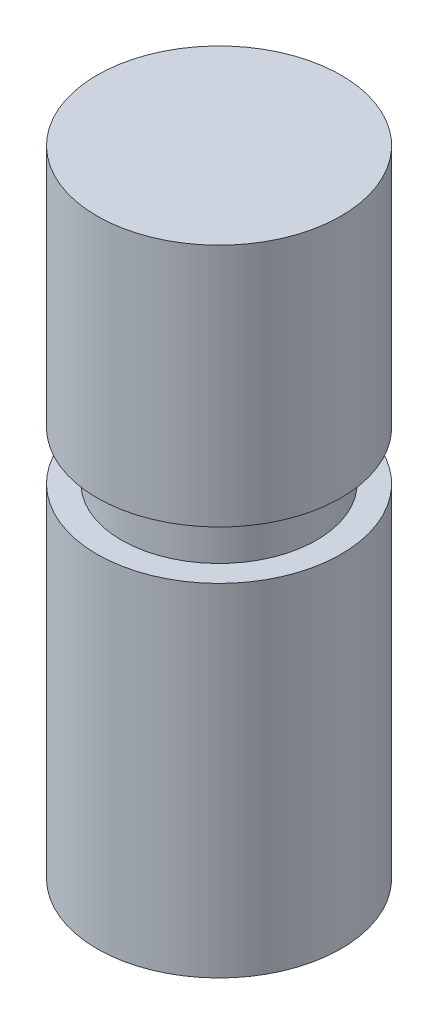
ISO-10303-21;
HEADER;
FILE_DESCRIPTION(('STEP AP214'),'2;1');
FILE_NAME('part.step','',(''),(''),'','','');
FILE_SCHEMA(('AUTOMOTIVE_DESIGN { 1 0 10303 214 1 1 1 1 }'));
ENDSEC;
DATA;
#1=APPLICATION_CONTEXT('core data for automotive mechanical design processes');
#2=APPLICATION_PROTOCOL_DEFINITION('international standard','automotive_design',2000,#1);
#3=PRODUCT_CONTEXT('',#1,'mechanical');
#4=PRODUCT('Part','Part','',(#3));
#5=PRODUCT_RELATED_PRODUCT_CATEGORY('part','',(#4));
#6=PRODUCT_DEFINITION_FORMATION('','',#4);
#7=PRODUCT_DEFINITION_CONTEXT('part definition',#1,'design');
#8=PRODUCT_DEFINITION('design','',#6,#7);
#9=PRODUCT_DEFINITION_SHAPE('','',#8);
#10=(LENGTH_UNIT() NAMED_UNIT(*) SI_UNIT(.MILLI.,.METRE.));
#11=(NAMED_UNIT(*) PLANE_ANGLE_UNIT() SI_UNIT($,.RADIAN.));
#12=(NAMED_UNIT(*) SI_UNIT($,.STERADIAN.) SOLID_ANGLE_UNIT());
#13=UNCERTAINTY_MEASURE_WITH_UNIT(LENGTH_MEASURE(1.E-05),#10,'distance_accuracy_value','');
#14=(GEOMETRIC_REPRESENTATION_CONTEXT(3) GLOBAL_UNCERTAINTY_ASSIGNED_CONTEXT((#13)) GLOBAL_UNIT_ASSIGNED_CONTEXT((#10,
#11,#12)) REPRESENTATION_CONTEXT('',''));
#15=CARTESIAN_POINT('',(0.,0.,0.));
#16=DIRECTION('',(0.,0.,1.));
#17=DIRECTION('',(1.,0.,0.));
#18=AXIS2_PLACEMENT_3D('',#15,#16,#17);
#19=CARTESIAN_POINT('',(0.,0.,0.));
#20=DIRECTION('',(0.,1.,0.));
#21=DIRECTION('',(0.,0.,1.));
#22=AXIS2_PLACEMENT_3D('',#19,#20,#21);
#23=CYLINDRICAL_SURFACE('',#22,25.);
#24=CARTESIAN_POINT('',(0.,0.,0.));
#25=DIRECTION('',(0.,1.,0.));
#26=DIRECTION('',(0.,0.,1.));
#27=AXIS2_PLACEMENT_3D('',#24,#25,#26);
#28=CIRCLE('',#27,25.);
#29=CARTESIAN_POINT('',(0.,0.,25.));
#30=VERTEX_POINT('',#29);
#31=EDGE_CURVE('E38',#30,#30,#28,.T.);
#32=ORIENTED_EDGE('',*,*,#31,.T.);
#33=EDGE_LOOP('',(#32));
#34=FACE_BOUND('',#33,.T.);
#35=CARTESIAN_POINT('',(0.,50.,0.));
#36=DIRECTION('',(0.,1.,0.));
#37=DIRECTION('',(0.,0.,1.));
#38=AXIS2_PLACEMENT_3D('',#35,#36,#37);
#39=CIRCLE('',#38,25.);
#40=CARTESIAN_POINT('',(0.,50.,25.));
#41=VERTEX_POINT('',#40);
#42=EDGE_CURVE('E42',#41,#41,#39,.T.);
#43=ORIENTED_EDGE('',*,*,#42,.F.);
#44=EDGE_LOOP('',(#43));
#45=FACE_BOUND('',#44,.T.);
#46=ADVANCED_FACE('F32',(#34,#45),#23,.T.);
#47=CARTESIAN_POINT('',(0.,0.,0.));
#48=DIRECTION('',(0.,1.,0.));
#49=DIRECTION('',(0.,0.,1.));
#50=AXIS2_PLACEMENT_3D('',#47,#48,#49);
#51=PLANE('',#50);
#52=CARTESIAN_POINT('',(0.,0.,0.));
#53=DIRECTION('',(0.,1.,0.));
#54=DIRECTION('',(0.,0.,1.));
#55=AXIS2_PLACEMENT_3D('',#52,#53,#54);
#56=CIRCLE('',#55,20.);
#57=CARTESIAN_POINT('',(0.,0.,20.));
#58=VERTEX_POINT('',#57);
#59=EDGE_CURVE('E10',#58,#58,#56,.F.);
#60=ORIENTED_EDGE('',*,*,#59,.F.);
#61=EDGE_LOOP('',(#60));
#62=FACE_BOUND('',#61,.T.);
#63=ORIENTED_EDGE('',*,*,#31,.F.);
#64=EDGE_LOOP('',(#63));
#65=FACE_BOUND('',#64,.T.);
#66=ADVANCED_FACE('F76',(#62,#65),#51,.F.);
#67=CARTESIAN_POINT('',(0.,50.,0.));
#68=DIRECTION('',(0.,1.,0.));
#69=DIRECTION('',(0.,0.,1.));
#70=AXIS2_PLACEMENT_3D('',#67,#68,#69);
#71=PLANE('',#70);
#72=ORIENTED_EDGE('',*,*,#42,.T.);
#73=EDGE_LOOP('',(#72));
#74=FACE_BOUND('',#73,.T.);
#75=ADVANCED_FACE('F80',(#74),#71,.T.);
#76=CARTESIAN_POINT('',(0.,40.,0.));
#77=DIRECTION('',(0.,-1.,0.));
#78=DIRECTION('',(0.,0.,-1.));
#79=AXIS2_PLACEMENT_3D('',#76,#77,#78);
#80=CYLINDRICAL_SURFACE('',#79,20.);
#81=CARTESIAN_POINT('',(0.,-9.99999999999999,0.));
#82=DIRECTION('',(0.,1.,0.));
#83=DIRECTION('',(0.,0.,1.));
#84=AXIS2_PLACEMENT_3D('',#81,#82,#83);
#85=CIRCLE('',#84,20.);
#86=CARTESIAN_POINT('',(0.,-9.99999999999999,20.));
#87=VERTEX_POINT('',#86);
#88=EDGE_CURVE('E47',#87,#87,#85,.T.);
#89=ORIENTED_EDGE('',*,*,#88,.T.);
#90=EDGE_LOOP('',(#89));
#91=FACE_BOUND('',#90,.T.);
#92=ORIENTED_EDGE('',*,*,#59,.T.);
#93=EDGE_LOOP('',(#92));
#94=FACE_BOUND('',#93,.T.);
#95=ADVANCED_FACE('F63',(#91,#94),#80,.T.);
#96=CARTESIAN_POINT('',(0.,-9.99999999999999,0.));
#97=DIRECTION('',(0.,-1.,0.));
#98=DIRECTION('',(0.,0.,-1.));
#99=AXIS2_PLACEMENT_3D('',#96,#97,#98);
#100=CYLINDRICAL_SURFACE('',#99,25.);
#101=CARTESIAN_POINT('',(0.,-9.99999999999999,0.));
#102=DIRECTION('',(0.,1.,0.));
#103=DIRECTION('',(0.,0.,1.));
#104=AXIS2_PLACEMENT_3D('',#101,#102,#103);
#105=CIRCLE('',#104,25.);
#106=CARTESIAN_POINT('',(0.,-9.99999999999999,25.));
#107=VERTEX_POINT('',#106);
#108=EDGE_CURVE('E51',#107,#107,#105,.T.);
#109=ORIENTED_EDGE('',*,*,#108,.F.);
#110=EDGE_LOOP('',(#109));
#111=FACE_BOUND('',#110,.T.);
#112=CARTESIAN_POINT('',(0.,-80.,0.));
#113=DIRECTION('',(0.,1.,0.));
#114=DIRECTION('',(0.,0.,1.));
#115=AXIS2_PLACEMENT_3D('',#112,#113,#114);
#116=CIRCLE('',#115,25.);
#117=CARTESIAN_POINT('',(0.,-80.,25.));
#118=VERTEX_POINT('',#117);
#119=EDGE_CURVE('E52',#118,#118,#116,.T.);
#120=ORIENTED_EDGE('',*,*,#119,.T.);
#121=EDGE_LOOP('',(#120));
#122=FACE_BOUND('',#121,.T.);
#123=ADVANCED_FACE('F60',(#111,#122),#100,.T.);
#124=CARTESIAN_POINT('',(0.,-9.99999999999999,0.));
#125=DIRECTION('',(0.,1.,0.));
#126=DIRECTION('',(0.,0.,1.));
#127=AXIS2_PLACEMENT_3D('',#124,#125,#126);
#128=PLANE('',#127);
#129=ORIENTED_EDGE('',*,*,#88,.F.);
#130=EDGE_LOOP('',(#129));
#131=FACE_BOUND('',#130,.T.);
#132=ORIENTED_EDGE('',*,*,#108,.T.);
#133=EDGE_LOOP('',(#132));
#134=FACE_BOUND('',#133,.T.);
#135=ADVANCED_FACE('F58',(#131,#134),#128,.T.);
#136=CARTESIAN_POINT('',(0.,-80.,0.));
#137=DIRECTION('',(0.,1.,0.));
#138=DIRECTION('',(0.,0.,1.));
#139=AXIS2_PLACEMENT_3D('',#136,#137,#138);
#140=PLANE('',#139);
#141=ORIENTED_EDGE('',*,*,#119,.F.);
#142=EDGE_LOOP('',(#141));
#143=FACE_BOUND('',#142,.T.);
#144=ADVANCED_FACE('F67',(#143),#140,.F.);
#145=CLOSED_SHELL('',(#46,#66,#75,#95,#123,#135,#144));
#146=MANIFOLD_SOLID_BREP('B2',#145);
#147=ADVANCED_BREP_SHAPE_REPRESENTATION('',(#18,#146),#14);
#148=SHAPE_DEFINITION_REPRESENTATION(#9,#147);
ENDSEC;
END-ISO-10303-21;
